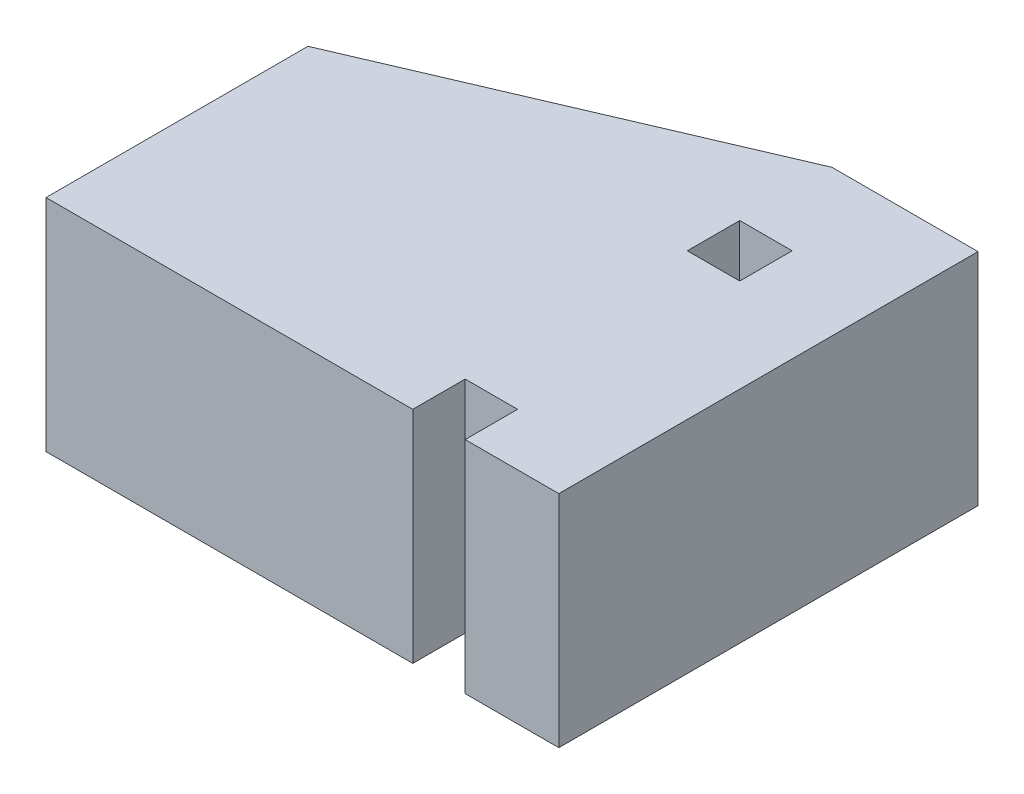
ISO-10303-21;
HEADER;
FILE_DESCRIPTION(('STEP AP214'),'2;1');
FILE_NAME('part.step','',(''),(''),'','','');
FILE_SCHEMA(('AUTOMOTIVE_DESIGN { 1 0 10303 214 1 1 1 1 }'));
ENDSEC;
DATA;
#1=APPLICATION_CONTEXT('core data for automotive mechanical design processes');
#2=APPLICATION_PROTOCOL_DEFINITION('international standard','automotive_design',2000,#1);
#3=PRODUCT_CONTEXT('',#1,'mechanical');
#4=PRODUCT('Part','Part','',(#3));
#5=PRODUCT_RELATED_PRODUCT_CATEGORY('part','',(#4));
#6=PRODUCT_DEFINITION_FORMATION('','',#4);
#7=PRODUCT_DEFINITION_CONTEXT('part definition',#1,'design');
#8=PRODUCT_DEFINITION('design','',#6,#7);
#9=PRODUCT_DEFINITION_SHAPE('','',#8);
#10=(LENGTH_UNIT() NAMED_UNIT(*) SI_UNIT(.MILLI.,.METRE.));
#11=(NAMED_UNIT(*) PLANE_ANGLE_UNIT() SI_UNIT($,.RADIAN.));
#12=(NAMED_UNIT(*) SI_UNIT($,.STERADIAN.) SOLID_ANGLE_UNIT());
#13=UNCERTAINTY_MEASURE_WITH_UNIT(LENGTH_MEASURE(1.E-05),#10,'distance_accuracy_value','');
#14=(GEOMETRIC_REPRESENTATION_CONTEXT(3) GLOBAL_UNCERTAINTY_ASSIGNED_CONTEXT((#13)) GLOBAL_UNIT_ASSIGNED_CONTEXT((#10,
#11,#12)) REPRESENTATION_CONTEXT('',''));
#15=CARTESIAN_POINT('',(0.,0.,0.));
#16=DIRECTION('',(0.,0.,1.));
#17=DIRECTION('',(1.,0.,0.));
#18=AXIS2_PLACEMENT_3D('',#15,#16,#17);
#19=CARTESIAN_POINT('',(0.,42.,0.));
#20=DIRECTION('',(0.,1.,0.));
#21=DIRECTION('',(0.,0.,1.));
#22=AXIS2_PLACEMENT_3D('',#19,#20,#21);
#23=PLANE('',#22);
#24=DIRECTION('',(1.,0.,0.));
#25=VECTOR('',#24,1.);
#26=CARTESIAN_POINT('',(0.,42.,21.2));
#27=LINE('',#26,#25);
#28=CARTESIAN_POINT('',(-9.99999999999997,42.,21.2));
#29=VERTEX_POINT('',#28);
#30=CARTESIAN_POINT('',(0.,42.,21.2));
#31=VERTEX_POINT('',#30);
#32=EDGE_CURVE('E166',#29,#31,#27,.T.);
#33=ORIENTED_EDGE('',*,*,#32,.T.);
#34=DIRECTION('',(0.,0.,1.));
#35=VECTOR('',#34,1.);
#36=CARTESIAN_POINT('',(0.,42.,21.2));
#37=LINE('',#36,#35);
#38=CARTESIAN_POINT('',(0.,42.,31.2));
#39=VERTEX_POINT('',#38);
#40=EDGE_CURVE('E169',#31,#39,#37,.T.);
#41=ORIENTED_EDGE('',*,*,#40,.T.);
#42=DIRECTION('',(1.,0.,0.));
#43=VECTOR('',#42,1.);
#44=CARTESIAN_POINT('',(0.,42.,31.2));
#45=LINE('',#44,#43);
#46=CARTESIAN_POINT('',(17.87,42.,31.2));
#47=VERTEX_POINT('',#46);
#48=EDGE_CURVE('E172',#39,#47,#45,.T.);
#49=ORIENTED_EDGE('',*,*,#48,.T.);
#50=DIRECTION('',(0.,0.,-1.));
#51=VECTOR('',#50,1.);
#52=CARTESIAN_POINT('',(17.87,42.,31.2));
#53=LINE('',#52,#51);
#54=CARTESIAN_POINT('',(17.87,42.,-48.8));
#55=VERTEX_POINT('',#54);
#56=EDGE_CURVE('E174',#47,#55,#53,.T.);
#57=ORIENTED_EDGE('',*,*,#56,.T.);
#58=DIRECTION('',(-1.,0.,0.));
#59=VECTOR('',#58,1.);
#60=CARTESIAN_POINT('',(-9.99999999999997,42.,-48.8));
#61=LINE('',#60,#59);
#62=CARTESIAN_POINT('',(-9.99999999999997,42.,-48.8));
#63=VERTEX_POINT('',#62);
#64=EDGE_CURVE('E176',#55,#63,#61,.T.);
#65=ORIENTED_EDGE('',*,*,#64,.T.);
#66=DIRECTION('',(-0.919145030018058,0.,0.393919298579168));
#67=VECTOR('',#66,1.);
#68=CARTESIAN_POINT('',(-80.,42.,-18.8));
#69=LINE('',#68,#67);
#70=CARTESIAN_POINT('',(-80.,42.,-18.8));
#71=VERTEX_POINT('',#70);
#72=EDGE_CURVE('E178',#63,#71,#69,.T.);
#73=ORIENTED_EDGE('',*,*,#72,.T.);
#74=DIRECTION('',(0.,0.,1.));
#75=VECTOR('',#74,1.);
#76=CARTESIAN_POINT('',(-80.,42.,31.2));
#77=LINE('',#76,#75);
#78=CARTESIAN_POINT('',(-80.,42.,31.2));
#79=VERTEX_POINT('',#78);
#80=EDGE_CURVE('E180',#71,#79,#77,.T.);
#81=ORIENTED_EDGE('',*,*,#80,.T.);
#82=DIRECTION('',(1.,0.,0.));
#83=VECTOR('',#82,1.);
#84=CARTESIAN_POINT('',(-9.99999999999996,42.,31.2));
#85=LINE('',#84,#83);
#86=CARTESIAN_POINT('',(-9.99999999999996,42.,31.2));
#87=VERTEX_POINT('',#86);
#88=EDGE_CURVE('E182',#79,#87,#85,.T.);
#89=ORIENTED_EDGE('',*,*,#88,.T.);
#90=DIRECTION('',(0.,0.,-1.));
#91=VECTOR('',#90,1.);
#92=CARTESIAN_POINT('',(-9.99999999999997,42.,21.2));
#93=LINE('',#92,#91);
#94=EDGE_CURVE('E184',#87,#29,#93,.T.);
#95=ORIENTED_EDGE('',*,*,#94,.T.);
#96=EDGE_LOOP('',(#33,#41,#49,#57,#65,#73,#81,#89,#95));
#97=FACE_BOUND('',#96,.T.);
#98=DIRECTION('',(0.,0.,-1.));
#99=VECTOR('',#98,1.);
#100=CARTESIAN_POINT('',(0.,42.,-21.2));
#101=LINE('',#100,#99);
#102=CARTESIAN_POINT('',(0.,42.,-21.2));
#103=VERTEX_POINT('',#102);
#104=CARTESIAN_POINT('',(0.,42.,-31.2));
#105=VERTEX_POINT('',#104);
#106=EDGE_CURVE('E138',#103,#105,#101,.T.);
#107=ORIENTED_EDGE('',*,*,#106,.F.);
#108=DIRECTION('',(1.,0.,0.));
#109=VECTOR('',#108,1.);
#110=CARTESIAN_POINT('',(0.,42.,-21.2));
#111=LINE('',#110,#109);
#112=CARTESIAN_POINT('',(-9.99999999999997,42.,-21.2));
#113=VERTEX_POINT('',#112);
#114=EDGE_CURVE('E130',#113,#103,#111,.T.);
#115=ORIENTED_EDGE('',*,*,#114,.F.);
#116=DIRECTION('',(0.,0.,1.));
#117=VECTOR('',#116,1.);
#118=CARTESIAN_POINT('',(-9.99999999999997,42.,-21.2));
#119=LINE('',#118,#117);
#120=CARTESIAN_POINT('',(-9.99999999999997,42.,-31.2));
#121=VERTEX_POINT('',#120);
#122=EDGE_CURVE('E152',#121,#113,#119,.T.);
#123=ORIENTED_EDGE('',*,*,#122,.F.);
#124=DIRECTION('',(-1.,0.,0.));
#125=VECTOR('',#124,1.);
#126=CARTESIAN_POINT('',(0.,42.,-31.2));
#127=LINE('',#126,#125);
#128=EDGE_CURVE('E150',#105,#121,#127,.T.);
#129=ORIENTED_EDGE('',*,*,#128,.F.);
#130=EDGE_LOOP('',(#107,#115,#123,#129));
#131=FACE_BOUND('',#130,.T.);
#132=ADVANCED_FACE('F35',(#97,#131),#23,.T.);
#133=CARTESIAN_POINT('',(0.,0.,0.));
#134=DIRECTION('',(0.,1.,0.));
#135=DIRECTION('',(0.,0.,1.));
#136=AXIS2_PLACEMENT_3D('',#133,#134,#135);
#137=PLANE('',#136);
#138=DIRECTION('',(1.,0.,0.));
#139=VECTOR('',#138,1.);
#140=CARTESIAN_POINT('',(0.,0.,21.2));
#141=LINE('',#140,#139);
#142=CARTESIAN_POINT('',(-9.99999999999997,0.,21.2));
#143=VERTEX_POINT('',#142);
#144=CARTESIAN_POINT('',(0.,0.,21.2));
#145=VERTEX_POINT('',#144);
#146=EDGE_CURVE('E146',#143,#145,#141,.T.);
#147=ORIENTED_EDGE('',*,*,#146,.F.);
#148=DIRECTION('',(0.,0.,-1.));
#149=VECTOR('',#148,1.);
#150=CARTESIAN_POINT('',(-9.99999999999997,0.,21.2));
#151=LINE('',#150,#149);
#152=CARTESIAN_POINT('',(-9.99999999999996,0.,31.2));
#153=VERTEX_POINT('',#152);
#154=EDGE_CURVE('E170',#153,#143,#151,.T.);
#155=ORIENTED_EDGE('',*,*,#154,.F.);
#156=DIRECTION('',(1.,0.,0.));
#157=VECTOR('',#156,1.);
#158=CARTESIAN_POINT('',(-9.99999999999996,0.,31.2));
#159=LINE('',#158,#157);
#160=CARTESIAN_POINT('',(-80.,0.,31.2));
#161=VERTEX_POINT('',#160);
#162=EDGE_CURVE('E201',#161,#153,#159,.T.);
#163=ORIENTED_EDGE('',*,*,#162,.F.);
#164=DIRECTION('',(0.,0.,1.));
#165=VECTOR('',#164,1.);
#166=CARTESIAN_POINT('',(-80.,0.,31.2));
#167=LINE('',#166,#165);
#168=CARTESIAN_POINT('',(-80.,0.,-18.8));
#169=VERTEX_POINT('',#168);
#170=EDGE_CURVE('E199',#169,#161,#167,.T.);
#171=ORIENTED_EDGE('',*,*,#170,.F.);
#172=DIRECTION('',(-0.919145030018058,0.,0.393919298579168));
#173=VECTOR('',#172,1.);
#174=CARTESIAN_POINT('',(-80.,0.,-18.8));
#175=LINE('',#174,#173);
#176=CARTESIAN_POINT('',(-9.99999999999997,0.,-48.8));
#177=VERTEX_POINT('',#176);
#178=EDGE_CURVE('E197',#177,#169,#175,.T.);
#179=ORIENTED_EDGE('',*,*,#178,.F.);
#180=DIRECTION('',(-1.,0.,0.));
#181=VECTOR('',#180,1.);
#182=CARTESIAN_POINT('',(-9.99999999999997,0.,-48.8));
#183=LINE('',#182,#181);
#184=CARTESIAN_POINT('',(17.87,0.,-48.8));
#185=VERTEX_POINT('',#184);
#186=EDGE_CURVE('E195',#185,#177,#183,.T.);
#187=ORIENTED_EDGE('',*,*,#186,.F.);
#188=DIRECTION('',(0.,0.,-1.));
#189=VECTOR('',#188,1.);
#190=CARTESIAN_POINT('',(17.87,0.,31.2));
#191=LINE('',#190,#189);
#192=CARTESIAN_POINT('',(17.87,0.,31.2));
#193=VERTEX_POINT('',#192);
#194=EDGE_CURVE('E193',#193,#185,#191,.T.);
#195=ORIENTED_EDGE('',*,*,#194,.F.);
#196=DIRECTION('',(1.,0.,0.));
#197=VECTOR('',#196,1.);
#198=CARTESIAN_POINT('',(0.,0.,31.2));
#199=LINE('',#198,#197);
#200=CARTESIAN_POINT('',(0.,0.,31.2));
#201=VERTEX_POINT('',#200);
#202=EDGE_CURVE('E191',#201,#193,#199,.T.);
#203=ORIENTED_EDGE('',*,*,#202,.F.);
#204=DIRECTION('',(0.,0.,1.));
#205=VECTOR('',#204,1.);
#206=CARTESIAN_POINT('',(0.,0.,21.2));
#207=LINE('',#206,#205);
#208=EDGE_CURVE('E189',#145,#201,#207,.T.);
#209=ORIENTED_EDGE('',*,*,#208,.F.);
#210=EDGE_LOOP('',(#147,#155,#163,#171,#179,#187,#195,#203,#209));
#211=FACE_BOUND('',#210,.T.);
#212=DIRECTION('',(1.,0.,0.));
#213=VECTOR('',#212,1.);
#214=CARTESIAN_POINT('',(0.,0.,-21.2));
#215=LINE('',#214,#213);
#216=CARTESIAN_POINT('',(-9.99999999999997,0.,-21.2));
#217=VERTEX_POINT('',#216);
#218=CARTESIAN_POINT('',(0.,0.,-21.2));
#219=VERTEX_POINT('',#218);
#220=EDGE_CURVE('E58',#217,#219,#215,.T.);
#221=ORIENTED_EDGE('',*,*,#220,.T.);
#222=DIRECTION('',(0.,0.,-1.));
#223=VECTOR('',#222,1.);
#224=CARTESIAN_POINT('',(0.,0.,-21.2));
#225=LINE('',#224,#223);
#226=CARTESIAN_POINT('',(0.,0.,-31.2));
#227=VERTEX_POINT('',#226);
#228=EDGE_CURVE('E145',#219,#227,#225,.T.);
#229=ORIENTED_EDGE('',*,*,#228,.T.);
#230=DIRECTION('',(-1.,0.,0.));
#231=VECTOR('',#230,1.);
#232=CARTESIAN_POINT('',(0.,0.,-31.2));
#233=LINE('',#232,#231);
#234=CARTESIAN_POINT('',(-9.99999999999997,0.,-31.2));
#235=VERTEX_POINT('',#234);
#236=EDGE_CURVE('E158',#227,#235,#233,.T.);
#237=ORIENTED_EDGE('',*,*,#236,.T.);
#238=DIRECTION('',(0.,0.,1.));
#239=VECTOR('',#238,1.);
#240=CARTESIAN_POINT('',(-9.99999999999997,0.,-21.2));
#241=LINE('',#240,#239);
#242=EDGE_CURVE('E139',#235,#217,#241,.T.);
#243=ORIENTED_EDGE('',*,*,#242,.T.);
#244=EDGE_LOOP('',(#221,#229,#237,#243));
#245=FACE_BOUND('',#244,.T.);
#246=ADVANCED_FACE('F234',(#211,#245),#137,.F.);
#247=CARTESIAN_POINT('',(0.,42.,21.2));
#248=DIRECTION('',(0.,0.,-1.));
#249=DIRECTION('',(-1.,0.,0.));
#250=AXIS2_PLACEMENT_3D('',#247,#248,#249);
#251=PLANE('',#250);
#252=ORIENTED_EDGE('',*,*,#146,.T.);
#253=DIRECTION('',(0.,-1.,0.));
#254=VECTOR('',#253,1.);
#255=CARTESIAN_POINT('',(0.,42.,21.2));
#256=LINE('',#255,#254);
#257=EDGE_CURVE('E11',#31,#145,#256,.T.);
#258=ORIENTED_EDGE('',*,*,#257,.F.);
#259=ORIENTED_EDGE('',*,*,#32,.F.);
#260=DIRECTION('',(0.,-1.,0.));
#261=VECTOR('',#260,1.);
#262=CARTESIAN_POINT('',(-9.99999999999997,42.,21.2));
#263=LINE('',#262,#261);
#264=EDGE_CURVE('E186',#29,#143,#263,.T.);
#265=ORIENTED_EDGE('',*,*,#264,.T.);
#266=EDGE_LOOP('',(#252,#258,#259,#265));
#267=FACE_BOUND('',#266,.T.);
#268=ADVANCED_FACE('F37',(#267),#251,.F.);
#269=CARTESIAN_POINT('',(0.,42.,21.2));
#270=DIRECTION('',(1.,0.,0.));
#271=DIRECTION('',(0.,0.,-1.));
#272=AXIS2_PLACEMENT_3D('',#269,#270,#271);
#273=PLANE('',#272);
#274=ORIENTED_EDGE('',*,*,#208,.T.);
#275=DIRECTION('',(0.,-1.,0.));
#276=VECTOR('',#275,1.);
#277=CARTESIAN_POINT('',(0.,42.,31.2));
#278=LINE('',#277,#276);
#279=EDGE_CURVE('E43',#39,#201,#278,.T.);
#280=ORIENTED_EDGE('',*,*,#279,.F.);
#281=ORIENTED_EDGE('',*,*,#40,.F.);
#282=ORIENTED_EDGE('',*,*,#257,.T.);
#283=EDGE_LOOP('',(#274,#280,#281,#282));
#284=FACE_BOUND('',#283,.T.);
#285=ADVANCED_FACE('F251',(#284),#273,.F.);
#286=CARTESIAN_POINT('',(0.,42.,31.2));
#287=DIRECTION('',(0.,0.,-1.));
#288=DIRECTION('',(-1.,0.,0.));
#289=AXIS2_PLACEMENT_3D('',#286,#287,#288);
#290=PLANE('',#289);
#291=ORIENTED_EDGE('',*,*,#202,.T.);
#292=DIRECTION('',(0.,-1.,0.));
#293=VECTOR('',#292,1.);
#294=CARTESIAN_POINT('',(17.87,42.,31.2));
#295=LINE('',#294,#293);
#296=EDGE_CURVE('E221',#47,#193,#295,.T.);
#297=ORIENTED_EDGE('',*,*,#296,.F.);
#298=ORIENTED_EDGE('',*,*,#48,.F.);
#299=ORIENTED_EDGE('',*,*,#279,.T.);
#300=EDGE_LOOP('',(#291,#297,#298,#299));
#301=FACE_BOUND('',#300,.T.);
#302=ADVANCED_FACE('F228',(#301),#290,.F.);
#303=CARTESIAN_POINT('',(17.87,42.,31.2));
#304=DIRECTION('',(-1.,0.,0.));
#305=DIRECTION('',(0.,0.,1.));
#306=AXIS2_PLACEMENT_3D('',#303,#304,#305);
#307=PLANE('',#306);
#308=ORIENTED_EDGE('',*,*,#194,.T.);
#309=DIRECTION('',(0.,-1.,0.));
#310=VECTOR('',#309,1.);
#311=CARTESIAN_POINT('',(17.87,42.,-48.8));
#312=LINE('',#311,#310);
#313=EDGE_CURVE('E218',#55,#185,#312,.T.);
#314=ORIENTED_EDGE('',*,*,#313,.F.);
#315=ORIENTED_EDGE('',*,*,#56,.F.);
#316=ORIENTED_EDGE('',*,*,#296,.T.);
#317=EDGE_LOOP('',(#308,#314,#315,#316));
#318=FACE_BOUND('',#317,.T.);
#319=ADVANCED_FACE('F240',(#318),#307,.F.);
#320=CARTESIAN_POINT('',(-9.99999999999997,42.,-48.8));
#321=DIRECTION('',(0.,0.,1.));
#322=DIRECTION('',(1.,0.,0.));
#323=AXIS2_PLACEMENT_3D('',#320,#321,#322);
#324=PLANE('',#323);
#325=ORIENTED_EDGE('',*,*,#186,.T.);
#326=DIRECTION('',(0.,-1.,0.));
#327=VECTOR('',#326,1.);
#328=CARTESIAN_POINT('',(-9.99999999999997,42.,-48.8));
#329=LINE('',#328,#327);
#330=EDGE_CURVE('E215',#63,#177,#329,.T.);
#331=ORIENTED_EDGE('',*,*,#330,.F.);
#332=ORIENTED_EDGE('',*,*,#64,.F.);
#333=ORIENTED_EDGE('',*,*,#313,.T.);
#334=EDGE_LOOP('',(#325,#331,#332,#333));
#335=FACE_BOUND('',#334,.T.);
#336=ADVANCED_FACE('F244',(#335),#324,.F.);
#337=CARTESIAN_POINT('',(-80.,42.,-18.8));
#338=DIRECTION('',(0.393919298579168,0.,0.919145030018058));
#339=DIRECTION('',(0.919145030018058,0.,-0.393919298579168));
#340=AXIS2_PLACEMENT_3D('',#337,#338,#339);
#341=PLANE('',#340);
#342=ORIENTED_EDGE('',*,*,#178,.T.);
#343=DIRECTION('',(0.,-1.,0.));
#344=VECTOR('',#343,1.);
#345=CARTESIAN_POINT('',(-80.,42.,-18.8));
#346=LINE('',#345,#344);
#347=EDGE_CURVE('E212',#71,#169,#346,.T.);
#348=ORIENTED_EDGE('',*,*,#347,.F.);
#349=ORIENTED_EDGE('',*,*,#72,.F.);
#350=ORIENTED_EDGE('',*,*,#330,.T.);
#351=EDGE_LOOP('',(#342,#348,#349,#350));
#352=FACE_BOUND('',#351,.T.);
#353=ADVANCED_FACE('F269',(#352),#341,.F.);
#354=CARTESIAN_POINT('',(-80.,42.,31.2));
#355=DIRECTION('',(1.,0.,0.));
#356=DIRECTION('',(0.,0.,-1.));
#357=AXIS2_PLACEMENT_3D('',#354,#355,#356);
#358=PLANE('',#357);
#359=ORIENTED_EDGE('',*,*,#170,.T.);
#360=DIRECTION('',(0.,-1.,0.));
#361=VECTOR('',#360,1.);
#362=CARTESIAN_POINT('',(-80.,42.,31.2));
#363=LINE('',#362,#361);
#364=EDGE_CURVE('E209',#79,#161,#363,.T.);
#365=ORIENTED_EDGE('',*,*,#364,.F.);
#366=ORIENTED_EDGE('',*,*,#80,.F.);
#367=ORIENTED_EDGE('',*,*,#347,.T.);
#368=EDGE_LOOP('',(#359,#365,#366,#367));
#369=FACE_BOUND('',#368,.T.);
#370=ADVANCED_FACE('F267',(#369),#358,.F.);
#371=CARTESIAN_POINT('',(-9.99999999999996,42.,31.2));
#372=DIRECTION('',(0.,0.,-1.));
#373=DIRECTION('',(-1.,0.,0.));
#374=AXIS2_PLACEMENT_3D('',#371,#372,#373);
#375=PLANE('',#374);
#376=ORIENTED_EDGE('',*,*,#162,.T.);
#377=DIRECTION('',(0.,-1.,0.));
#378=VECTOR('',#377,1.);
#379=CARTESIAN_POINT('',(-9.99999999999996,42.,31.2));
#380=LINE('',#379,#378);
#381=EDGE_CURVE('E206',#87,#153,#380,.T.);
#382=ORIENTED_EDGE('',*,*,#381,.F.);
#383=ORIENTED_EDGE('',*,*,#88,.F.);
#384=ORIENTED_EDGE('',*,*,#364,.T.);
#385=EDGE_LOOP('',(#376,#382,#383,#384));
#386=FACE_BOUND('',#385,.T.);
#387=ADVANCED_FACE('F263',(#386),#375,.F.);
#388=CARTESIAN_POINT('',(-9.99999999999997,42.,21.2));
#389=DIRECTION('',(-1.,0.,0.));
#390=DIRECTION('',(0.,0.,1.));
#391=AXIS2_PLACEMENT_3D('',#388,#389,#390);
#392=PLANE('',#391);
#393=ORIENTED_EDGE('',*,*,#154,.T.);
#394=ORIENTED_EDGE('',*,*,#264,.F.);
#395=ORIENTED_EDGE('',*,*,#94,.F.);
#396=ORIENTED_EDGE('',*,*,#381,.T.);
#397=EDGE_LOOP('',(#393,#394,#395,#396));
#398=FACE_BOUND('',#397,.T.);
#399=ADVANCED_FACE('F258',(#398),#392,.F.);
#400=CARTESIAN_POINT('',(0.,42.,-21.2));
#401=DIRECTION('',(0.,0.,-1.));
#402=DIRECTION('',(-1.,0.,0.));
#403=AXIS2_PLACEMENT_3D('',#400,#401,#402);
#404=PLANE('',#403);
#405=ORIENTED_EDGE('',*,*,#220,.F.);
#406=DIRECTION('',(0.,-1.,0.));
#407=VECTOR('',#406,1.);
#408=CARTESIAN_POINT('',(-9.99999999999997,42.,-21.2));
#409=LINE('',#408,#407);
#410=EDGE_CURVE('E134',#113,#217,#409,.T.);
#411=ORIENTED_EDGE('',*,*,#410,.F.);
#412=ORIENTED_EDGE('',*,*,#114,.T.);
#413=DIRECTION('',(0.,-1.,0.));
#414=VECTOR('',#413,1.);
#415=CARTESIAN_POINT('',(0.,42.,-21.2));
#416=LINE('',#415,#414);
#417=EDGE_CURVE('E133',#103,#219,#416,.T.);
#418=ORIENTED_EDGE('',*,*,#417,.T.);
#419=EDGE_LOOP('',(#405,#411,#412,#418));
#420=FACE_BOUND('',#419,.T.);
#421=ADVANCED_FACE('F132',(#420),#404,.T.);
#422=CARTESIAN_POINT('',(0.,42.,-21.2));
#423=DIRECTION('',(-1.,0.,0.));
#424=DIRECTION('',(0.,0.,1.));
#425=AXIS2_PLACEMENT_3D('',#422,#423,#424);
#426=PLANE('',#425);
#427=ORIENTED_EDGE('',*,*,#228,.F.);
#428=ORIENTED_EDGE('',*,*,#417,.F.);
#429=ORIENTED_EDGE('',*,*,#106,.T.);
#430=DIRECTION('',(0.,-1.,0.));
#431=VECTOR('',#430,1.);
#432=CARTESIAN_POINT('',(0.,42.,-31.2));
#433=LINE('',#432,#431);
#434=EDGE_CURVE('E147',#105,#227,#433,.T.);
#435=ORIENTED_EDGE('',*,*,#434,.T.);
#436=EDGE_LOOP('',(#427,#428,#429,#435));
#437=FACE_BOUND('',#436,.T.);
#438=ADVANCED_FACE('F142',(#437),#426,.T.);
#439=CARTESIAN_POINT('',(0.,42.,-31.2));
#440=DIRECTION('',(0.,0.,1.));
#441=DIRECTION('',(1.,0.,0.));
#442=AXIS2_PLACEMENT_3D('',#439,#440,#441);
#443=PLANE('',#442);
#444=ORIENTED_EDGE('',*,*,#236,.F.);
#445=ORIENTED_EDGE('',*,*,#434,.F.);
#446=ORIENTED_EDGE('',*,*,#128,.T.);
#447=DIRECTION('',(0.,-1.,0.));
#448=VECTOR('',#447,1.);
#449=CARTESIAN_POINT('',(-9.99999999999997,42.,-31.2));
#450=LINE('',#449,#448);
#451=EDGE_CURVE('E50',#121,#235,#450,.T.);
#452=ORIENTED_EDGE('',*,*,#451,.T.);
#453=EDGE_LOOP('',(#444,#445,#446,#452));
#454=FACE_BOUND('',#453,.T.);
#455=ADVANCED_FACE('F309',(#454),#443,.T.);
#456=CARTESIAN_POINT('',(-9.99999999999997,42.,-21.2));
#457=DIRECTION('',(1.,0.,0.));
#458=DIRECTION('',(0.,0.,-1.));
#459=AXIS2_PLACEMENT_3D('',#456,#457,#458);
#460=PLANE('',#459);
#461=ORIENTED_EDGE('',*,*,#242,.F.);
#462=ORIENTED_EDGE('',*,*,#451,.F.);
#463=ORIENTED_EDGE('',*,*,#122,.T.);
#464=ORIENTED_EDGE('',*,*,#410,.T.);
#465=EDGE_LOOP('',(#461,#462,#463,#464));
#466=FACE_BOUND('',#465,.T.);
#467=ADVANCED_FACE('F315',(#466),#460,.T.);
#468=CLOSED_SHELL('',(#132,#246,#268,#285,#302,#319,#336,#353,#370,#387,#399,#421,#438,#455,#467));
#469=MANIFOLD_SOLID_BREP('B2',#468);
#470=ADVANCED_BREP_SHAPE_REPRESENTATION('',(#18,#469),#14);
#471=SHAPE_DEFINITION_REPRESENTATION(#9,#470);
ENDSEC;
END-ISO-10303-21;
